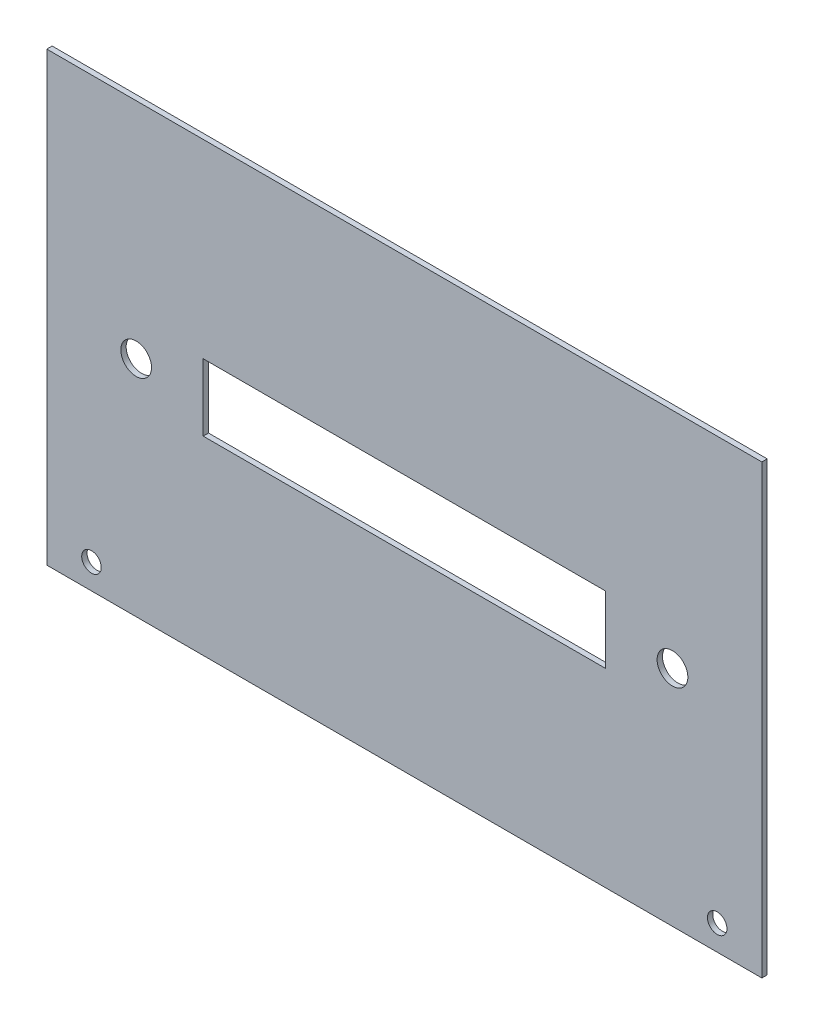
ISO-10303-21;
HEADER;
FILE_DESCRIPTION(('STEP AP214'),'2;1');
FILE_NAME('part.step','',(''),(''),'','','');
FILE_SCHEMA(('AUTOMOTIVE_DESIGN { 1 0 10303 214 1 1 1 1 }'));
ENDSEC;
DATA;
#1=APPLICATION_CONTEXT('core data for automotive mechanical design processes');
#2=APPLICATION_PROTOCOL_DEFINITION('international standard','automotive_design',2000,#1);
#3=PRODUCT_CONTEXT('',#1,'mechanical');
#4=PRODUCT('Part','Part','',(#3));
#5=PRODUCT_RELATED_PRODUCT_CATEGORY('part','',(#4));
#6=PRODUCT_DEFINITION_FORMATION('','',#4);
#7=PRODUCT_DEFINITION_CONTEXT('part definition',#1,'design');
#8=PRODUCT_DEFINITION('design','',#6,#7);
#9=PRODUCT_DEFINITION_SHAPE('','',#8);
#10=(LENGTH_UNIT() NAMED_UNIT(*) SI_UNIT(.MILLI.,.METRE.));
#11=(NAMED_UNIT(*) PLANE_ANGLE_UNIT() SI_UNIT($,.RADIAN.));
#12=(NAMED_UNIT(*) SI_UNIT($,.STERADIAN.) SOLID_ANGLE_UNIT());
#13=UNCERTAINTY_MEASURE_WITH_UNIT(LENGTH_MEASURE(1.E-05),#10,'distance_accuracy_value','');
#14=(GEOMETRIC_REPRESENTATION_CONTEXT(3) GLOBAL_UNCERTAINTY_ASSIGNED_CONTEXT((#13)) GLOBAL_UNIT_ASSIGNED_CONTEXT((#10,
#11,#12)) REPRESENTATION_CONTEXT('',''));
#15=CARTESIAN_POINT('',(0.,0.,0.));
#16=DIRECTION('',(0.,0.,1.));
#17=DIRECTION('',(1.,0.,0.));
#18=AXIS2_PLACEMENT_3D('',#15,#16,#17);
#19=CARTESIAN_POINT('',(101.6,-63.5,-1.51892));
#20=DIRECTION('',(1.,0.,0.));
#21=DIRECTION('',(0.,0.,-1.));
#22=AXIS2_PLACEMENT_3D('',#19,#20,#21);
#23=PLANE('',#22);
#24=DIRECTION('',(0.,1.,0.));
#25=VECTOR('',#24,1.);
#26=CARTESIAN_POINT('',(101.6,-63.5,0.));
#27=LINE('',#26,#25);
#28=CARTESIAN_POINT('',(101.6,-63.5,0.));
#29=VERTEX_POINT('',#28);
#30=CARTESIAN_POINT('',(101.6,63.5,0.));
#31=VERTEX_POINT('',#30);
#32=EDGE_CURVE('E142',#29,#31,#27,.T.);
#33=ORIENTED_EDGE('',*,*,#32,.F.);
#34=DIRECTION('',(0.,0.,1.));
#35=VECTOR('',#34,1.);
#36=CARTESIAN_POINT('',(101.6,-63.5,-1.51892));
#37=LINE('',#36,#35);
#38=CARTESIAN_POINT('',(101.6,-63.5,-1.51892));
#39=VERTEX_POINT('',#38);
#40=EDGE_CURVE('E11',#39,#29,#37,.T.);
#41=ORIENTED_EDGE('',*,*,#40,.F.);
#42=DIRECTION('',(0.,1.,0.));
#43=VECTOR('',#42,1.);
#44=CARTESIAN_POINT('',(101.6,-63.5,-1.51892));
#45=LINE('',#44,#43);
#46=CARTESIAN_POINT('',(101.6,63.5,-1.51892));
#47=VERTEX_POINT('',#46);
#48=EDGE_CURVE('E146',#39,#47,#45,.T.);
#49=ORIENTED_EDGE('',*,*,#48,.T.);
#50=DIRECTION('',(0.,0.,1.));
#51=VECTOR('',#50,1.);
#52=CARTESIAN_POINT('',(101.6,63.5,-1.51892));
#53=LINE('',#52,#51);
#54=EDGE_CURVE('E43',#47,#31,#53,.T.);
#55=ORIENTED_EDGE('',*,*,#54,.T.);
#56=EDGE_LOOP('',(#33,#41,#49,#55));
#57=FACE_BOUND('',#56,.T.);
#58=ADVANCED_FACE('F40',(#57),#23,.T.);
#59=CARTESIAN_POINT('',(-101.6,-63.5,-1.51892));
#60=DIRECTION('',(0.,-1.,0.));
#61=DIRECTION('',(0.,0.,-1.));
#62=AXIS2_PLACEMENT_3D('',#59,#60,#61);
#63=PLANE('',#62);
#64=DIRECTION('',(1.,0.,0.));
#65=VECTOR('',#64,1.);
#66=CARTESIAN_POINT('',(-101.6,-63.5,0.));
#67=LINE('',#66,#65);
#68=CARTESIAN_POINT('',(-101.6,-63.5,0.));
#69=VERTEX_POINT('',#68);
#70=EDGE_CURVE('E150',#69,#29,#67,.T.);
#71=ORIENTED_EDGE('',*,*,#70,.F.);
#72=DIRECTION('',(0.,0.,1.));
#73=VECTOR('',#72,1.);
#74=CARTESIAN_POINT('',(-101.6,-63.5,-1.51892));
#75=LINE('',#74,#73);
#76=CARTESIAN_POINT('',(-101.6,-63.5,-1.51892));
#77=VERTEX_POINT('',#76);
#78=EDGE_CURVE('E48',#77,#69,#75,.T.);
#79=ORIENTED_EDGE('',*,*,#78,.F.);
#80=DIRECTION('',(1.,0.,0.));
#81=VECTOR('',#80,1.);
#82=CARTESIAN_POINT('',(-101.6,-63.5,-1.51892));
#83=LINE('',#82,#81);
#84=EDGE_CURVE('E156',#77,#39,#83,.T.);
#85=ORIENTED_EDGE('',*,*,#84,.T.);
#86=ORIENTED_EDGE('',*,*,#40,.T.);
#87=EDGE_LOOP('',(#71,#79,#85,#86));
#88=FACE_BOUND('',#87,.T.);
#89=ADVANCED_FACE('F182',(#88),#63,.T.);
#90=CARTESIAN_POINT('',(-101.6,-63.5,-1.51892));
#91=DIRECTION('',(-1.,0.,0.));
#92=DIRECTION('',(0.,0.,1.));
#93=AXIS2_PLACEMENT_3D('',#90,#91,#92);
#94=PLANE('',#93);
#95=DIRECTION('',(0.,-1.,0.));
#96=VECTOR('',#95,1.);
#97=CARTESIAN_POINT('',(-101.6,-63.5,0.));
#98=LINE('',#97,#96);
#99=CARTESIAN_POINT('',(-101.6,63.5,0.));
#100=VERTEX_POINT('',#99);
#101=EDGE_CURVE('E164',#100,#69,#98,.T.);
#102=ORIENTED_EDGE('',*,*,#101,.F.);
#103=DIRECTION('',(0.,0.,1.));
#104=VECTOR('',#103,1.);
#105=CARTESIAN_POINT('',(-101.6,63.5,-1.51892));
#106=LINE('',#105,#104);
#107=CARTESIAN_POINT('',(-101.6,63.5,-1.51892));
#108=VERTEX_POINT('',#107);
#109=EDGE_CURVE('E169',#108,#100,#106,.T.);
#110=ORIENTED_EDGE('',*,*,#109,.F.);
#111=DIRECTION('',(0.,-1.,0.));
#112=VECTOR('',#111,1.);
#113=CARTESIAN_POINT('',(-101.6,-63.5,-1.51892));
#114=LINE('',#113,#112);
#115=EDGE_CURVE('E153',#108,#77,#114,.T.);
#116=ORIENTED_EDGE('',*,*,#115,.T.);
#117=ORIENTED_EDGE('',*,*,#78,.T.);
#118=EDGE_LOOP('',(#102,#110,#116,#117));
#119=FACE_BOUND('',#118,.T.);
#120=ADVANCED_FACE('F186',(#119),#94,.T.);
#121=CARTESIAN_POINT('',(-101.6,63.5,-1.51892));
#122=DIRECTION('',(0.,1.,0.));
#123=DIRECTION('',(0.,0.,1.));
#124=AXIS2_PLACEMENT_3D('',#121,#122,#123);
#125=PLANE('',#124);
#126=DIRECTION('',(-1.,0.,0.));
#127=VECTOR('',#126,1.);
#128=CARTESIAN_POINT('',(-101.6,63.5,0.));
#129=LINE('',#128,#127);
#130=EDGE_CURVE('E161',#31,#100,#129,.T.);
#131=ORIENTED_EDGE('',*,*,#130,.F.);
#132=ORIENTED_EDGE('',*,*,#54,.F.);
#133=DIRECTION('',(-1.,0.,0.));
#134=VECTOR('',#133,1.);
#135=CARTESIAN_POINT('',(-101.6,63.5,-1.51892));
#136=LINE('',#135,#134);
#137=EDGE_CURVE('E149',#47,#108,#136,.T.);
#138=ORIENTED_EDGE('',*,*,#137,.T.);
#139=ORIENTED_EDGE('',*,*,#109,.T.);
#140=EDGE_LOOP('',(#131,#132,#138,#139));
#141=FACE_BOUND('',#140,.T.);
#142=ADVANCED_FACE('F177',(#141),#125,.T.);
#143=CARTESIAN_POINT('',(0.,0.,-1.51892));
#144=DIRECTION('',(0.,0.,-1.));
#145=DIRECTION('',(-1.,0.,0.));
#146=AXIS2_PLACEMENT_3D('',#143,#144,#145);
#147=PLANE('',#146);
#148=CARTESIAN_POINT('',(-88.9,-56.35625,-1.51892));
#149=DIRECTION('',(0.,0.,1.));
#150=DIRECTION('',(1.,0.,0.));
#151=AXIS2_PLACEMENT_3D('',#148,#149,#150);
#152=CIRCLE('',#151,2.778125);
#153=CARTESIAN_POINT('',(-86.121875,-56.35625,-1.51892));
#154=VERTEX_POINT('',#153);
#155=EDGE_CURVE('E369',#154,#154,#152,.T.);
#156=ORIENTED_EDGE('',*,*,#155,.T.);
#157=EDGE_LOOP('',(#156));
#158=FACE_BOUND('',#157,.T.);
#159=CARTESIAN_POINT('',(88.9,-56.35625,-1.51892));
#160=DIRECTION('',(0.,0.,1.));
#161=DIRECTION('',(-1.,0.,0.));
#162=AXIS2_PLACEMENT_3D('',#159,#160,#161);
#163=CIRCLE('',#162,2.778125);
#164=CARTESIAN_POINT('',(86.121875,-56.35625,-1.51892));
#165=VERTEX_POINT('',#164);
#166=EDGE_CURVE('E378',#165,#165,#163,.T.);
#167=ORIENTED_EDGE('',*,*,#166,.T.);
#168=EDGE_LOOP('',(#167));
#169=FACE_BOUND('',#168,.T.);
#170=CARTESIAN_POINT('',(76.2,4.16333634234434E-13,-1.51892));
#171=DIRECTION('',(0.,0.,1.));
#172=DIRECTION('',(-1.,0.,0.));
#173=AXIS2_PLACEMENT_3D('',#170,#171,#172);
#174=CIRCLE('',#173,4.36562499999999);
#175=CARTESIAN_POINT('',(71.834375,4.16333634234434E-13,-1.51892));
#176=VERTEX_POINT('',#175);
#177=EDGE_CURVE('E383',#176,#176,#174,.T.);
#178=ORIENTED_EDGE('',*,*,#177,.T.);
#179=EDGE_LOOP('',(#178));
#180=FACE_BOUND('',#179,.T.);
#181=CARTESIAN_POINT('',(-76.2,0.,-1.51892));
#182=DIRECTION('',(0.,0.,1.));
#183=DIRECTION('',(1.,0.,0.));
#184=AXIS2_PLACEMENT_3D('',#181,#182,#183);
#185=CIRCLE('',#184,4.365625);
#186=CARTESIAN_POINT('',(-71.834375,0.,-1.51892));
#187=VERTEX_POINT('',#186);
#188=EDGE_CURVE('E136',#187,#187,#185,.T.);
#189=ORIENTED_EDGE('',*,*,#188,.T.);
#190=EDGE_LOOP('',(#189));
#191=FACE_BOUND('',#190,.T.);
#192=DIRECTION('',(0.,1.,0.));
#193=VECTOR('',#192,1.);
#194=CARTESIAN_POINT('',(57.15,-9.525,-1.51892));
#195=LINE('',#194,#193);
#196=CARTESIAN_POINT('',(57.15,-9.525,-1.51892));
#197=VERTEX_POINT('',#196);
#198=CARTESIAN_POINT('',(57.15,9.525,-1.51892));
#199=VERTEX_POINT('',#198);
#200=EDGE_CURVE('E107',#197,#199,#195,.T.);
#201=ORIENTED_EDGE('',*,*,#200,.T.);
#202=DIRECTION('',(-1.,0.,0.));
#203=VECTOR('',#202,1.);
#204=CARTESIAN_POINT('',(-57.15,9.525,-1.51892));
#205=LINE('',#204,#203);
#206=CARTESIAN_POINT('',(-57.15,9.525,-1.51892));
#207=VERTEX_POINT('',#206);
#208=EDGE_CURVE('E116',#199,#207,#205,.T.);
#209=ORIENTED_EDGE('',*,*,#208,.T.);
#210=DIRECTION('',(0.,-1.,0.));
#211=VECTOR('',#210,1.);
#212=CARTESIAN_POINT('',(-57.15,-9.525,-1.51892));
#213=LINE('',#212,#211);
#214=CARTESIAN_POINT('',(-57.15,-9.525,-1.51892));
#215=VERTEX_POINT('',#214);
#216=EDGE_CURVE('E56',#207,#215,#213,.T.);
#217=ORIENTED_EDGE('',*,*,#216,.T.);
#218=DIRECTION('',(1.,0.,0.));
#219=VECTOR('',#218,1.);
#220=CARTESIAN_POINT('',(-57.15,-9.525,-1.51892));
#221=LINE('',#220,#219);
#222=EDGE_CURVE('E113',#215,#197,#221,.T.);
#223=ORIENTED_EDGE('',*,*,#222,.T.);
#224=EDGE_LOOP('',(#201,#209,#217,#223));
#225=FACE_BOUND('',#224,.T.);
#226=ORIENTED_EDGE('',*,*,#48,.F.);
#227=ORIENTED_EDGE('',*,*,#84,.F.);
#228=ORIENTED_EDGE('',*,*,#115,.F.);
#229=ORIENTED_EDGE('',*,*,#137,.F.);
#230=EDGE_LOOP('',(#226,#227,#228,#229));
#231=FACE_BOUND('',#230,.T.);
#232=ADVANCED_FACE('F120',(#158,#169,#180,#191,#225,#231),#147,.T.);
#233=CARTESIAN_POINT('',(0.,0.,0.));
#234=DIRECTION('',(0.,0.,-1.));
#235=DIRECTION('',(-1.,0.,0.));
#236=AXIS2_PLACEMENT_3D('',#233,#234,#235);
#237=PLANE('',#236);
#238=CARTESIAN_POINT('',(-88.9,-56.35625,0.));
#239=DIRECTION('',(0.,0.,1.));
#240=DIRECTION('',(1.,0.,0.));
#241=AXIS2_PLACEMENT_3D('',#238,#239,#240);
#242=CIRCLE('',#241,2.778125);
#243=CARTESIAN_POINT('',(-86.121875,-56.35625,0.));
#244=VERTEX_POINT('',#243);
#245=EDGE_CURVE('E372',#244,#244,#242,.T.);
#246=ORIENTED_EDGE('',*,*,#245,.F.);
#247=EDGE_LOOP('',(#246));
#248=FACE_BOUND('',#247,.T.);
#249=CARTESIAN_POINT('',(88.9,-56.35625,0.));
#250=DIRECTION('',(0.,0.,1.));
#251=DIRECTION('',(-1.,0.,0.));
#252=AXIS2_PLACEMENT_3D('',#249,#250,#251);
#253=CIRCLE('',#252,2.778125);
#254=CARTESIAN_POINT('',(86.121875,-56.35625,0.));
#255=VERTEX_POINT('',#254);
#256=EDGE_CURVE('E373',#255,#255,#253,.T.);
#257=ORIENTED_EDGE('',*,*,#256,.F.);
#258=EDGE_LOOP('',(#257));
#259=FACE_BOUND('',#258,.T.);
#260=CARTESIAN_POINT('',(76.2,4.16333634234434E-13,0.));
#261=DIRECTION('',(0.,0.,1.));
#262=DIRECTION('',(-1.,0.,0.));
#263=AXIS2_PLACEMENT_3D('',#260,#261,#262);
#264=CIRCLE('',#263,4.36562499999999);
#265=CARTESIAN_POINT('',(71.834375,4.16333634234434E-13,0.));
#266=VERTEX_POINT('',#265);
#267=EDGE_CURVE('E375',#266,#266,#264,.T.);
#268=ORIENTED_EDGE('',*,*,#267,.F.);
#269=EDGE_LOOP('',(#268));
#270=FACE_BOUND('',#269,.T.);
#271=CARTESIAN_POINT('',(-76.2,0.,0.));
#272=DIRECTION('',(0.,0.,1.));
#273=DIRECTION('',(1.,0.,0.));
#274=AXIS2_PLACEMENT_3D('',#271,#272,#273);
#275=CIRCLE('',#274,4.365625);
#276=CARTESIAN_POINT('',(-71.834375,0.,0.));
#277=VERTEX_POINT('',#276);
#278=EDGE_CURVE('E129',#277,#277,#275,.T.);
#279=ORIENTED_EDGE('',*,*,#278,.F.);
#280=EDGE_LOOP('',(#279));
#281=FACE_BOUND('',#280,.T.);
#282=DIRECTION('',(-1.,0.,0.));
#283=VECTOR('',#282,1.);
#284=CARTESIAN_POINT('',(-57.15,9.525,0.));
#285=LINE('',#284,#283);
#286=CARTESIAN_POINT('',(57.15,9.525,0.));
#287=VERTEX_POINT('',#286);
#288=CARTESIAN_POINT('',(-57.15,9.525,0.));
#289=VERTEX_POINT('',#288);
#290=EDGE_CURVE('E135',#287,#289,#285,.T.);
#291=ORIENTED_EDGE('',*,*,#290,.F.);
#292=DIRECTION('',(0.,1.,0.));
#293=VECTOR('',#292,1.);
#294=CARTESIAN_POINT('',(57.15,-9.525,0.));
#295=LINE('',#294,#293);
#296=CARTESIAN_POINT('',(57.15,-9.525,0.));
#297=VERTEX_POINT('',#296);
#298=EDGE_CURVE('E64',#297,#287,#295,.T.);
#299=ORIENTED_EDGE('',*,*,#298,.F.);
#300=DIRECTION('',(1.,0.,0.));
#301=VECTOR('',#300,1.);
#302=CARTESIAN_POINT('',(-57.15,-9.525,0.));
#303=LINE('',#302,#301);
#304=CARTESIAN_POINT('',(-57.15,-9.525,0.));
#305=VERTEX_POINT('',#304);
#306=EDGE_CURVE('E123',#305,#297,#303,.T.);
#307=ORIENTED_EDGE('',*,*,#306,.F.);
#308=DIRECTION('',(0.,-1.,0.));
#309=VECTOR('',#308,1.);
#310=CARTESIAN_POINT('',(-57.15,-9.525,0.));
#311=LINE('',#310,#309);
#312=EDGE_CURVE('E126',#289,#305,#311,.T.);
#313=ORIENTED_EDGE('',*,*,#312,.F.);
#314=EDGE_LOOP('',(#291,#299,#307,#313));
#315=FACE_BOUND('',#314,.T.);
#316=ORIENTED_EDGE('',*,*,#32,.T.);
#317=ORIENTED_EDGE('',*,*,#130,.T.);
#318=ORIENTED_EDGE('',*,*,#101,.T.);
#319=ORIENTED_EDGE('',*,*,#70,.T.);
#320=EDGE_LOOP('',(#316,#317,#318,#319));
#321=FACE_BOUND('',#320,.T.);
#322=ADVANCED_FACE('F179',(#248,#259,#270,#281,#315,#321),#237,.F.);
#323=CARTESIAN_POINT('',(57.15,-9.525,-1.51892));
#324=DIRECTION('',(1.,0.,0.));
#325=DIRECTION('',(0.,0.,-1.));
#326=AXIS2_PLACEMENT_3D('',#323,#324,#325);
#327=PLANE('',#326);
#328=ORIENTED_EDGE('',*,*,#298,.T.);
#329=DIRECTION('',(0.,0.,1.));
#330=VECTOR('',#329,1.);
#331=CARTESIAN_POINT('',(57.15,9.525,-1.51892));
#332=LINE('',#331,#330);
#333=EDGE_CURVE('E103',#199,#287,#332,.T.);
#334=ORIENTED_EDGE('',*,*,#333,.F.);
#335=ORIENTED_EDGE('',*,*,#200,.F.);
#336=DIRECTION('',(0.,0.,1.));
#337=VECTOR('',#336,1.);
#338=CARTESIAN_POINT('',(57.15,-9.525,-1.51892));
#339=LINE('',#338,#337);
#340=EDGE_CURVE('E140',#197,#297,#339,.T.);
#341=ORIENTED_EDGE('',*,*,#340,.T.);
#342=EDGE_LOOP('',(#328,#334,#335,#341));
#343=FACE_BOUND('',#342,.T.);
#344=ADVANCED_FACE('F105',(#343),#327,.F.);
#345=CARTESIAN_POINT('',(-57.15,-9.525,-1.51892));
#346=DIRECTION('',(0.,-1.,0.));
#347=DIRECTION('',(0.,0.,-1.));
#348=AXIS2_PLACEMENT_3D('',#345,#346,#347);
#349=PLANE('',#348);
#350=ORIENTED_EDGE('',*,*,#306,.T.);
#351=ORIENTED_EDGE('',*,*,#340,.F.);
#352=ORIENTED_EDGE('',*,*,#222,.F.);
#353=DIRECTION('',(0.,0.,1.));
#354=VECTOR('',#353,1.);
#355=CARTESIAN_POINT('',(-57.15,-9.525,-1.51892));
#356=LINE('',#355,#354);
#357=EDGE_CURVE('E143',#215,#305,#356,.T.);
#358=ORIENTED_EDGE('',*,*,#357,.T.);
#359=EDGE_LOOP('',(#350,#351,#352,#358));
#360=FACE_BOUND('',#359,.T.);
#361=ADVANCED_FACE('F225',(#360),#349,.F.);
#362=CARTESIAN_POINT('',(-57.15,-9.525,-1.51892));
#363=DIRECTION('',(-1.,0.,0.));
#364=DIRECTION('',(0.,0.,1.));
#365=AXIS2_PLACEMENT_3D('',#362,#363,#364);
#366=PLANE('',#365);
#367=ORIENTED_EDGE('',*,*,#312,.T.);
#368=ORIENTED_EDGE('',*,*,#357,.F.);
#369=ORIENTED_EDGE('',*,*,#216,.F.);
#370=DIRECTION('',(0.,0.,1.));
#371=VECTOR('',#370,1.);
#372=CARTESIAN_POINT('',(-57.15,9.525,-1.51892));
#373=LINE('',#372,#371);
#374=EDGE_CURVE('E112',#207,#289,#373,.T.);
#375=ORIENTED_EDGE('',*,*,#374,.T.);
#376=EDGE_LOOP('',(#367,#368,#369,#375));
#377=FACE_BOUND('',#376,.T.);
#378=ADVANCED_FACE('F237',(#377),#366,.F.);
#379=CARTESIAN_POINT('',(-57.15,9.525,-1.51892));
#380=DIRECTION('',(0.,1.,0.));
#381=DIRECTION('',(0.,0.,1.));
#382=AXIS2_PLACEMENT_3D('',#379,#380,#381);
#383=PLANE('',#382);
#384=ORIENTED_EDGE('',*,*,#290,.T.);
#385=ORIENTED_EDGE('',*,*,#374,.F.);
#386=ORIENTED_EDGE('',*,*,#208,.F.);
#387=ORIENTED_EDGE('',*,*,#333,.T.);
#388=EDGE_LOOP('',(#384,#385,#386,#387));
#389=FACE_BOUND('',#388,.T.);
#390=ADVANCED_FACE('F117',(#389),#383,.F.);
#391=CARTESIAN_POINT('',(-76.2,0.,-1.51892));
#392=DIRECTION('',(0.,0.,1.));
#393=DIRECTION('',(1.,0.,0.));
#394=AXIS2_PLACEMENT_3D('',#391,#392,#393);
#395=CYLINDRICAL_SURFACE('',#394,4.365625);
#396=ORIENTED_EDGE('',*,*,#188,.F.);
#397=EDGE_LOOP('',(#396));
#398=FACE_BOUND('',#397,.T.);
#399=ORIENTED_EDGE('',*,*,#278,.T.);
#400=EDGE_LOOP('',(#399));
#401=FACE_BOUND('',#400,.T.);
#402=ADVANCED_FACE('F257',(#398,#401),#395,.F.);
#403=CARTESIAN_POINT('',(76.2,4.16333634234434E-13,-1.51892));
#404=DIRECTION('',(0.,0.,1.));
#405=DIRECTION('',(1.,0.,0.));
#406=AXIS2_PLACEMENT_3D('',#403,#404,#405);
#407=CYLINDRICAL_SURFACE('',#406,4.36562499999999);
#408=ORIENTED_EDGE('',*,*,#177,.F.);
#409=EDGE_LOOP('',(#408));
#410=FACE_BOUND('',#409,.T.);
#411=ORIENTED_EDGE('',*,*,#267,.T.);
#412=EDGE_LOOP('',(#411));
#413=FACE_BOUND('',#412,.T.);
#414=ADVANCED_FACE('F267',(#410,#413),#407,.F.);
#415=CARTESIAN_POINT('',(88.9,-56.35625,-1.51892));
#416=DIRECTION('',(0.,0.,1.));
#417=DIRECTION('',(1.,0.,0.));
#418=AXIS2_PLACEMENT_3D('',#415,#416,#417);
#419=CYLINDRICAL_SURFACE('',#418,2.778125);
#420=ORIENTED_EDGE('',*,*,#166,.F.);
#421=EDGE_LOOP('',(#420));
#422=FACE_BOUND('',#421,.T.);
#423=ORIENTED_EDGE('',*,*,#256,.T.);
#424=EDGE_LOOP('',(#423));
#425=FACE_BOUND('',#424,.T.);
#426=ADVANCED_FACE('F278',(#422,#425),#419,.F.);
#427=CARTESIAN_POINT('',(-88.9,-56.35625,-1.51892));
#428=DIRECTION('',(0.,0.,1.));
#429=DIRECTION('',(1.,0.,0.));
#430=AXIS2_PLACEMENT_3D('',#427,#428,#429);
#431=CYLINDRICAL_SURFACE('',#430,2.778125);
#432=ORIENTED_EDGE('',*,*,#155,.F.);
#433=EDGE_LOOP('',(#432));
#434=FACE_BOUND('',#433,.T.);
#435=ORIENTED_EDGE('',*,*,#245,.T.);
#436=EDGE_LOOP('',(#435));
#437=FACE_BOUND('',#436,.T.);
#438=ADVANCED_FACE('F299',(#434,#437),#431,.F.);
#439=CLOSED_SHELL('',(#58,#89,#120,#142,#232,#322,#344,#361,#378,#390,#402,#414,#426,#438));
#440=MANIFOLD_SOLID_BREP('B2',#439);
#441=ADVANCED_BREP_SHAPE_REPRESENTATION('',(#18,#440),#14);
#442=SHAPE_DEFINITION_REPRESENTATION(#9,#441);
ENDSEC;
END-ISO-10303-21;
